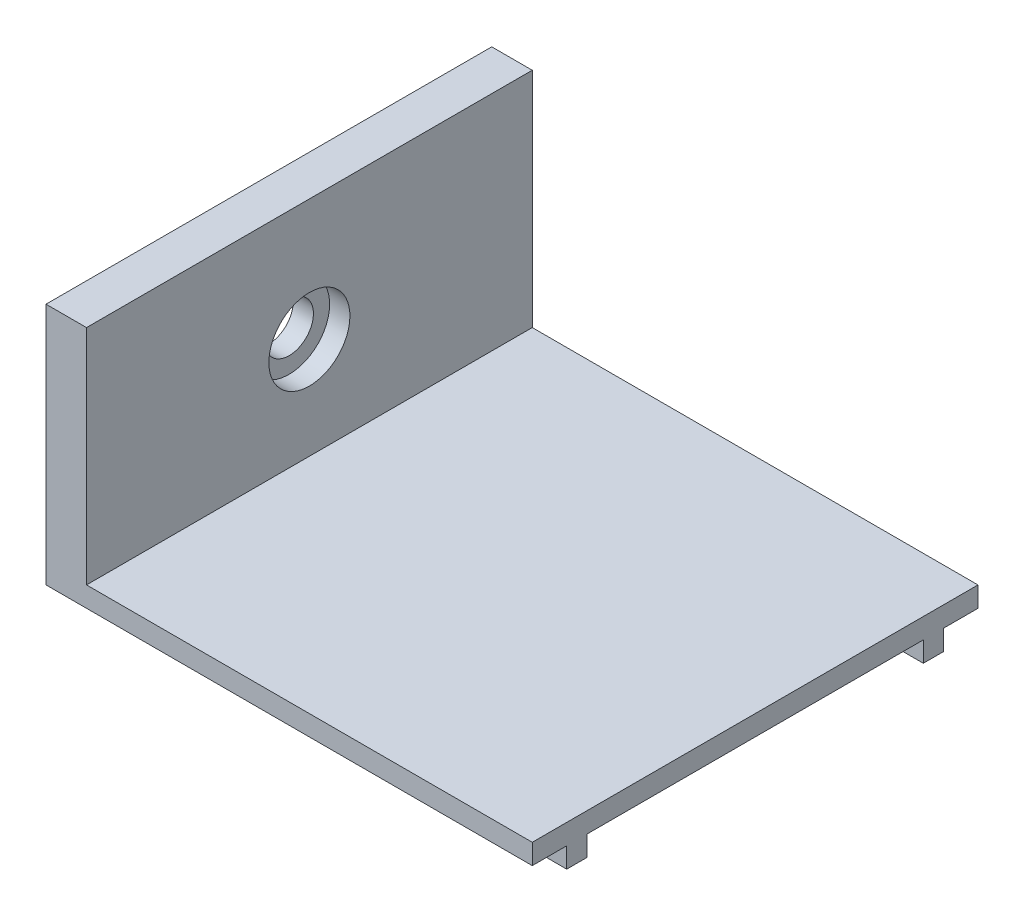
ISO-10303-21;
HEADER;
FILE_DESCRIPTION(('STEP AP214'),'2;1');
FILE_NAME('part.step','',(''),(''),'','','');
FILE_SCHEMA(('AUTOMOTIVE_DESIGN { 1 0 10303 214 1 1 1 1 }'));
ENDSEC;
DATA;
#1=APPLICATION_CONTEXT('core data for automotive mechanical design processes');
#2=APPLICATION_PROTOCOL_DEFINITION('international standard','automotive_design',2000,#1);
#3=PRODUCT_CONTEXT('',#1,'mechanical');
#4=PRODUCT('Part','Part','',(#3));
#5=PRODUCT_RELATED_PRODUCT_CATEGORY('part','',(#4));
#6=PRODUCT_DEFINITION_FORMATION('','',#4);
#7=PRODUCT_DEFINITION_CONTEXT('part definition',#1,'design');
#8=PRODUCT_DEFINITION('design','',#6,#7);
#9=PRODUCT_DEFINITION_SHAPE('','',#8);
#10=(LENGTH_UNIT() NAMED_UNIT(*) SI_UNIT(.MILLI.,.METRE.));
#11=(NAMED_UNIT(*) PLANE_ANGLE_UNIT() SI_UNIT($,.RADIAN.));
#12=(NAMED_UNIT(*) SI_UNIT($,.STERADIAN.) SOLID_ANGLE_UNIT());
#13=UNCERTAINTY_MEASURE_WITH_UNIT(LENGTH_MEASURE(1.E-05),#10,'distance_accuracy_value','');
#14=(GEOMETRIC_REPRESENTATION_CONTEXT(3) GLOBAL_UNCERTAINTY_ASSIGNED_CONTEXT((#13)) GLOBAL_UNIT_ASSIGNED_CONTEXT((#10,
#11,#12)) REPRESENTATION_CONTEXT('',''));
#15=CARTESIAN_POINT('',(0.,0.,0.));
#16=DIRECTION('',(0.,0.,1.));
#17=DIRECTION('',(1.,0.,0.));
#18=AXIS2_PLACEMENT_3D('',#15,#16,#17);
#19=CARTESIAN_POINT('',(120.,0.,110.));
#20=DIRECTION('',(0.,1.,0.));
#21=DIRECTION('',(-1.,0.,0.));
#22=AXIS2_PLACEMENT_3D('',#19,#20,#21);
#23=PLANE('',#22);
#24=DIRECTION('',(-1.,0.,0.));
#25=VECTOR('',#24,1.);
#26=CARTESIAN_POINT('',(0.,0.,13.5));
#27=LINE('',#26,#25);
#28=CARTESIAN_POINT('',(120.,0.,13.5));
#29=VERTEX_POINT('',#28);
#30=CARTESIAN_POINT('',(0.,0.,13.5));
#31=VERTEX_POINT('',#30);
#32=EDGE_CURVE('E58',#29,#31,#27,.T.);
#33=ORIENTED_EDGE('',*,*,#32,.F.);
#34=DIRECTION('',(0.,0.,-1.));
#35=VECTOR('',#34,1.);
#36=CARTESIAN_POINT('',(120.,0.,110.));
#37=LINE('',#36,#35);
#38=CARTESIAN_POINT('',(120.,0.,96.5));
#39=VERTEX_POINT('',#38);
#40=EDGE_CURVE('E43',#39,#29,#37,.T.);
#41=ORIENTED_EDGE('',*,*,#40,.F.);
#42=DIRECTION('',(1.,0.,0.));
#43=VECTOR('',#42,1.);
#44=CARTESIAN_POINT('',(0.,0.,96.5));
#45=LINE('',#44,#43);
#46=CARTESIAN_POINT('',(0.,0.,96.5));
#47=VERTEX_POINT('',#46);
#48=EDGE_CURVE('E145',#47,#39,#45,.T.);
#49=ORIENTED_EDGE('',*,*,#48,.F.);
#50=DIRECTION('',(0.,0.,-1.));
#51=VECTOR('',#50,1.);
#52=CARTESIAN_POINT('',(0.,0.,110.));
#53=LINE('',#52,#51);
#54=EDGE_CURVE('E231',#47,#31,#53,.T.);
#55=ORIENTED_EDGE('',*,*,#54,.T.);
#56=EDGE_LOOP('',(#33,#41,#49,#55));
#57=FACE_BOUND('',#56,.T.);
#58=ADVANCED_FACE('F35',(#57),#23,.F.);
#59=CARTESIAN_POINT('',(120.,0.,8.49999999999999));
#60=VERTEX_POINT('',#59);
#61=CARTESIAN_POINT('',(120.,0.,0.));
#62=VERTEX_POINT('',#61);
#63=EDGE_CURVE('E44',#60,#62,#37,.T.);
#64=ORIENTED_EDGE('',*,*,#63,.F.);
#65=DIRECTION('',(-1.,0.,0.));
#66=VECTOR('',#65,1.);
#67=CARTESIAN_POINT('',(0.,0.,8.49999999999999));
#68=LINE('',#67,#66);
#69=CARTESIAN_POINT('',(0.,0.,8.49999999999999));
#70=VERTEX_POINT('',#69);
#71=EDGE_CURVE('E143',#60,#70,#68,.T.);
#72=ORIENTED_EDGE('',*,*,#71,.T.);
#73=CARTESIAN_POINT('',(0.,0.,0.));
#74=VERTEX_POINT('',#73);
#75=EDGE_CURVE('E216',#70,#74,#53,.T.);
#76=ORIENTED_EDGE('',*,*,#75,.T.);
#77=DIRECTION('',(1.,0.,0.));
#78=VECTOR('',#77,1.);
#79=CARTESIAN_POINT('',(120.,0.,0.));
#80=LINE('',#79,#78);
#81=EDGE_CURVE('E201',#74,#62,#80,.T.);
#82=ORIENTED_EDGE('',*,*,#81,.T.);
#83=EDGE_LOOP('',(#64,#72,#76,#82));
#84=FACE_BOUND('',#83,.T.);
#85=ADVANCED_FACE('F256',(#84),#23,.F.);
#86=CARTESIAN_POINT('',(0.,0.,110.));
#87=VERTEX_POINT('',#86);
#88=CARTESIAN_POINT('',(0.,0.,101.5));
#89=VERTEX_POINT('',#88);
#90=EDGE_CURVE('E228',#87,#89,#53,.T.);
#91=ORIENTED_EDGE('',*,*,#90,.T.);
#92=DIRECTION('',(1.,0.,0.));
#93=VECTOR('',#92,1.);
#94=CARTESIAN_POINT('',(0.,0.,101.5));
#95=LINE('',#94,#93);
#96=CARTESIAN_POINT('',(120.,0.,101.5));
#97=VERTEX_POINT('',#96);
#98=EDGE_CURVE('E179',#89,#97,#95,.T.);
#99=ORIENTED_EDGE('',*,*,#98,.T.);
#100=CARTESIAN_POINT('',(120.,0.,110.));
#101=VERTEX_POINT('',#100);
#102=EDGE_CURVE('E11',#101,#97,#37,.T.);
#103=ORIENTED_EDGE('',*,*,#102,.F.);
#104=DIRECTION('',(1.,0.,0.));
#105=VECTOR('',#104,1.);
#106=CARTESIAN_POINT('',(120.,0.,110.));
#107=LINE('',#106,#105);
#108=EDGE_CURVE('E202',#87,#101,#107,.T.);
#109=ORIENTED_EDGE('',*,*,#108,.F.);
#110=EDGE_LOOP('',(#91,#99,#103,#109));
#111=FACE_BOUND('',#110,.T.);
#112=ADVANCED_FACE('F37',(#111),#23,.F.);
#113=CARTESIAN_POINT('',(120.,5.,110.));
#114=DIRECTION('',(-1.,0.,0.));
#115=DIRECTION('',(0.,0.,1.));
#116=AXIS2_PLACEMENT_3D('',#113,#114,#115);
#117=PLANE('',#116);
#118=DIRECTION('',(0.,1.,0.));
#119=VECTOR('',#118,1.);
#120=CARTESIAN_POINT('',(120.,5.,0.));
#121=LINE('',#120,#119);
#122=CARTESIAN_POINT('',(120.,5.,0.));
#123=VERTEX_POINT('',#122);
#124=EDGE_CURVE('E218',#62,#123,#121,.T.);
#125=ORIENTED_EDGE('',*,*,#124,.T.);
#126=DIRECTION('',(0.,0.,-1.));
#127=VECTOR('',#126,1.);
#128=CARTESIAN_POINT('',(120.,5.,110.));
#129=LINE('',#128,#127);
#130=CARTESIAN_POINT('',(120.,5.,110.));
#131=VERTEX_POINT('',#130);
#132=EDGE_CURVE('E239',#131,#123,#129,.T.);
#133=ORIENTED_EDGE('',*,*,#132,.F.);
#134=DIRECTION('',(0.,1.,0.));
#135=VECTOR('',#134,1.);
#136=CARTESIAN_POINT('',(120.,5.,110.));
#137=LINE('',#136,#135);
#138=EDGE_CURVE('E205',#101,#131,#137,.T.);
#139=ORIENTED_EDGE('',*,*,#138,.F.);
#140=ORIENTED_EDGE('',*,*,#102,.T.);
#141=DIRECTION('',(0.,1.,0.));
#142=VECTOR('',#141,1.);
#143=CARTESIAN_POINT('',(120.,-4.99999999999999,101.5));
#144=LINE('',#143,#142);
#145=CARTESIAN_POINT('',(120.,-4.99999999999999,101.5));
#146=VERTEX_POINT('',#145);
#147=EDGE_CURVE('E192',#146,#97,#144,.T.);
#148=ORIENTED_EDGE('',*,*,#147,.F.);
#149=DIRECTION('',(0.,0.,1.));
#150=VECTOR('',#149,1.);
#151=CARTESIAN_POINT('',(120.,-4.99999999999999,0.));
#152=LINE('',#151,#150);
#153=CARTESIAN_POINT('',(120.,-4.99999999999999,96.5));
#154=VERTEX_POINT('',#153);
#155=EDGE_CURVE('E181',#154,#146,#152,.T.);
#156=ORIENTED_EDGE('',*,*,#155,.F.);
#157=DIRECTION('',(0.,1.,0.));
#158=VECTOR('',#157,1.);
#159=CARTESIAN_POINT('',(120.,-4.99999999999999,96.5));
#160=LINE('',#159,#158);
#161=EDGE_CURVE('E195',#154,#39,#160,.T.);
#162=ORIENTED_EDGE('',*,*,#161,.T.);
#163=ORIENTED_EDGE('',*,*,#40,.T.);
#164=DIRECTION('',(0.,1.,0.));
#165=VECTOR('',#164,1.);
#166=CARTESIAN_POINT('',(120.,-4.99999999999999,13.5));
#167=LINE('',#166,#165);
#168=CARTESIAN_POINT('',(120.,-4.99999999999999,13.5));
#169=VERTEX_POINT('',#168);
#170=EDGE_CURVE('E146',#169,#29,#167,.T.);
#171=ORIENTED_EDGE('',*,*,#170,.F.);
#172=DIRECTION('',(0.,0.,1.));
#173=VECTOR('',#172,1.);
#174=CARTESIAN_POINT('',(120.,-4.99999999999999,0.));
#175=LINE('',#174,#173);
#176=CARTESIAN_POINT('',(120.,-4.99999999999999,8.49999999999999));
#177=VERTEX_POINT('',#176);
#178=EDGE_CURVE('E149',#177,#169,#175,.T.);
#179=ORIENTED_EDGE('',*,*,#178,.F.);
#180=DIRECTION('',(0.,1.,0.));
#181=VECTOR('',#180,1.);
#182=CARTESIAN_POINT('',(120.,-4.99999999999999,8.49999999999999));
#183=LINE('',#182,#181);
#184=EDGE_CURVE('E137',#177,#60,#183,.T.);
#185=ORIENTED_EDGE('',*,*,#184,.T.);
#186=ORIENTED_EDGE('',*,*,#63,.T.);
#187=EDGE_LOOP('',(#125,#133,#139,#140,#148,#156,#162,#163,#171,#179,#185,#186));
#188=FACE_BOUND('',#187,.T.);
#189=ADVANCED_FACE('F150',(#188),#117,.F.);
#190=CARTESIAN_POINT('',(10.,5.,110.));
#191=DIRECTION('',(0.,-1.,0.));
#192=DIRECTION('',(1.,0.,0.));
#193=AXIS2_PLACEMENT_3D('',#190,#191,#192);
#194=PLANE('',#193);
#195=DIRECTION('',(-1.,0.,0.));
#196=VECTOR('',#195,1.);
#197=CARTESIAN_POINT('',(10.,5.,0.));
#198=LINE('',#197,#196);
#199=CARTESIAN_POINT('',(10.,5.,0.));
#200=VERTEX_POINT('',#199);
#201=EDGE_CURVE('E220',#123,#200,#198,.T.);
#202=ORIENTED_EDGE('',*,*,#201,.T.);
#203=DIRECTION('',(0.,0.,-1.));
#204=VECTOR('',#203,1.);
#205=CARTESIAN_POINT('',(10.,5.,110.));
#206=LINE('',#205,#204);
#207=CARTESIAN_POINT('',(10.,5.,110.));
#208=VERTEX_POINT('',#207);
#209=EDGE_CURVE('E237',#208,#200,#206,.T.);
#210=ORIENTED_EDGE('',*,*,#209,.F.);
#211=DIRECTION('',(-1.,0.,0.));
#212=VECTOR('',#211,1.);
#213=CARTESIAN_POINT('',(10.,5.,110.));
#214=LINE('',#213,#212);
#215=EDGE_CURVE('E208',#131,#208,#214,.T.);
#216=ORIENTED_EDGE('',*,*,#215,.F.);
#217=ORIENTED_EDGE('',*,*,#132,.T.);
#218=EDGE_LOOP('',(#202,#210,#216,#217));
#219=FACE_BOUND('',#218,.T.);
#220=ADVANCED_FACE('F292',(#219),#194,.F.);
#221=CARTESIAN_POINT('',(10.,60.,110.));
#222=DIRECTION('',(-1.,0.,0.));
#223=DIRECTION('',(0.,-1.,0.));
#224=AXIS2_PLACEMENT_3D('',#221,#222,#223);
#225=PLANE('',#224);
#226=CARTESIAN_POINT('',(10.,30.,55.));
#227=DIRECTION('',(1.,0.,0.));
#228=DIRECTION('',(0.,1.,0.));
#229=AXIS2_PLACEMENT_3D('',#226,#227,#228);
#230=CIRCLE('',#229,10.);
#231=CARTESIAN_POINT('',(10.,40.,55.));
#232=VERTEX_POINT('',#231);
#233=EDGE_CURVE('E475',#232,#232,#230,.T.);
#234=ORIENTED_EDGE('',*,*,#233,.F.);
#235=EDGE_LOOP('',(#234));
#236=FACE_BOUND('',#235,.T.);
#237=DIRECTION('',(0.,1.,0.));
#238=VECTOR('',#237,1.);
#239=CARTESIAN_POINT('',(10.,60.,0.));
#240=LINE('',#239,#238);
#241=CARTESIAN_POINT('',(10.,60.,0.));
#242=VERTEX_POINT('',#241);
#243=EDGE_CURVE('E222',#200,#242,#240,.T.);
#244=ORIENTED_EDGE('',*,*,#243,.T.);
#245=DIRECTION('',(0.,0.,-1.));
#246=VECTOR('',#245,1.);
#247=CARTESIAN_POINT('',(10.,60.,110.));
#248=LINE('',#247,#246);
#249=CARTESIAN_POINT('',(10.,60.,110.));
#250=VERTEX_POINT('',#249);
#251=EDGE_CURVE('E234',#250,#242,#248,.T.);
#252=ORIENTED_EDGE('',*,*,#251,.F.);
#253=DIRECTION('',(0.,1.,0.));
#254=VECTOR('',#253,1.);
#255=CARTESIAN_POINT('',(10.,60.,110.));
#256=LINE('',#255,#254);
#257=EDGE_CURVE('E210',#208,#250,#256,.T.);
#258=ORIENTED_EDGE('',*,*,#257,.F.);
#259=ORIENTED_EDGE('',*,*,#209,.T.);
#260=EDGE_LOOP('',(#244,#252,#258,#259));
#261=FACE_BOUND('',#260,.T.);
#262=ADVANCED_FACE('F380',(#236,#261),#225,.F.);
#263=CARTESIAN_POINT('',(0.,60.,110.));
#264=DIRECTION('',(0.,-1.,0.));
#265=DIRECTION('',(0.,0.,-1.));
#266=AXIS2_PLACEMENT_3D('',#263,#264,#265);
#267=PLANE('',#266);
#268=DIRECTION('',(-1.,0.,0.));
#269=VECTOR('',#268,1.);
#270=CARTESIAN_POINT('',(0.,60.,0.));
#271=LINE('',#270,#269);
#272=CARTESIAN_POINT('',(0.,60.,0.));
#273=VERTEX_POINT('',#272);
#274=EDGE_CURVE('E224',#242,#273,#271,.T.);
#275=ORIENTED_EDGE('',*,*,#274,.T.);
#276=DIRECTION('',(0.,0.,-1.));
#277=VECTOR('',#276,1.);
#278=CARTESIAN_POINT('',(0.,60.,110.));
#279=LINE('',#278,#277);
#280=CARTESIAN_POINT('',(0.,60.,110.));
#281=VERTEX_POINT('',#280);
#282=EDGE_CURVE('E230',#281,#273,#279,.T.);
#283=ORIENTED_EDGE('',*,*,#282,.F.);
#284=DIRECTION('',(-1.,0.,0.));
#285=VECTOR('',#284,1.);
#286=CARTESIAN_POINT('',(0.,60.,110.));
#287=LINE('',#286,#285);
#288=EDGE_CURVE('E212',#250,#281,#287,.T.);
#289=ORIENTED_EDGE('',*,*,#288,.F.);
#290=ORIENTED_EDGE('',*,*,#251,.T.);
#291=EDGE_LOOP('',(#275,#283,#289,#290));
#292=FACE_BOUND('',#291,.T.);
#293=ADVANCED_FACE('F361',(#292),#267,.F.);
#294=CARTESIAN_POINT('',(0.,0.,110.));
#295=DIRECTION('',(1.,0.,0.));
#296=DIRECTION('',(0.,0.,-1.));
#297=AXIS2_PLACEMENT_3D('',#294,#295,#296);
#298=PLANE('',#297);
#299=CARTESIAN_POINT('',(0.,30.,55.));
#300=DIRECTION('',(-1.,0.,0.));
#301=DIRECTION('',(0.,0.,1.));
#302=AXIS2_PLACEMENT_3D('',#299,#300,#301);
#303=CIRCLE('',#302,5.99999999999999);
#304=CARTESIAN_POINT('',(0.,30.,61.));
#305=VERTEX_POINT('',#304);
#306=EDGE_CURVE('E163',#305,#305,#303,.T.);
#307=ORIENTED_EDGE('',*,*,#306,.F.);
#308=EDGE_LOOP('',(#307));
#309=FACE_BOUND('',#308,.T.);
#310=DIRECTION('',(0.,-1.,0.));
#311=VECTOR('',#310,1.);
#312=CARTESIAN_POINT('',(0.,0.,0.));
#313=LINE('',#312,#311);
#314=EDGE_CURVE('E206',#273,#74,#313,.T.);
#315=ORIENTED_EDGE('',*,*,#314,.T.);
#316=ORIENTED_EDGE('',*,*,#75,.F.);
#317=DIRECTION('',(0.,1.,0.));
#318=VECTOR('',#317,1.);
#319=CARTESIAN_POINT('',(0.,-5.,8.49999999999999));
#320=LINE('',#319,#318);
#321=CARTESIAN_POINT('',(0.,-5.,8.49999999999999));
#322=VERTEX_POINT('',#321);
#323=EDGE_CURVE('E168',#322,#70,#320,.T.);
#324=ORIENTED_EDGE('',*,*,#323,.F.);
#325=DIRECTION('',(0.,0.,-1.));
#326=VECTOR('',#325,1.);
#327=CARTESIAN_POINT('',(0.,-5.,0.));
#328=LINE('',#327,#326);
#329=CARTESIAN_POINT('',(0.,-5.,13.5));
#330=VERTEX_POINT('',#329);
#331=EDGE_CURVE('E158',#330,#322,#328,.T.);
#332=ORIENTED_EDGE('',*,*,#331,.F.);
#333=DIRECTION('',(0.,1.,0.));
#334=VECTOR('',#333,1.);
#335=CARTESIAN_POINT('',(0.,-5.,13.5));
#336=LINE('',#335,#334);
#337=EDGE_CURVE('E171',#330,#31,#336,.T.);
#338=ORIENTED_EDGE('',*,*,#337,.T.);
#339=ORIENTED_EDGE('',*,*,#54,.F.);
#340=DIRECTION('',(0.,1.,0.));
#341=VECTOR('',#340,1.);
#342=CARTESIAN_POINT('',(0.,-5.,96.5));
#343=LINE('',#342,#341);
#344=CARTESIAN_POINT('',(0.,-5.,96.5));
#345=VERTEX_POINT('',#344);
#346=EDGE_CURVE('E198',#345,#47,#343,.T.);
#347=ORIENTED_EDGE('',*,*,#346,.F.);
#348=DIRECTION('',(0.,0.,-1.));
#349=VECTOR('',#348,1.);
#350=CARTESIAN_POINT('',(0.,-5.,0.));
#351=LINE('',#350,#349);
#352=CARTESIAN_POINT('',(0.,-5.,101.5));
#353=VERTEX_POINT('',#352);
#354=EDGE_CURVE('E175',#353,#345,#351,.T.);
#355=ORIENTED_EDGE('',*,*,#354,.F.);
#356=DIRECTION('',(0.,1.,0.));
#357=VECTOR('',#356,1.);
#358=CARTESIAN_POINT('',(0.,-5.,101.5));
#359=LINE('',#358,#357);
#360=EDGE_CURVE('E186',#353,#89,#359,.T.);
#361=ORIENTED_EDGE('',*,*,#360,.T.);
#362=ORIENTED_EDGE('',*,*,#90,.F.);
#363=DIRECTION('',(0.,-1.,0.));
#364=VECTOR('',#363,1.);
#365=CARTESIAN_POINT('',(0.,0.,110.));
#366=LINE('',#365,#364);
#367=EDGE_CURVE('E214',#281,#87,#366,.T.);
#368=ORIENTED_EDGE('',*,*,#367,.F.);
#369=ORIENTED_EDGE('',*,*,#282,.T.);
#370=EDGE_LOOP('',(#315,#316,#324,#332,#338,#339,#347,#355,#361,#362,#368,#369));
#371=FACE_BOUND('',#370,.T.);
#372=ADVANCED_FACE('F253',(#309,#371),#298,.F.);
#373=CARTESIAN_POINT('',(0.,0.,110.));
#374=DIRECTION('',(0.,0.,-1.));
#375=DIRECTION('',(-1.,0.,0.));
#376=AXIS2_PLACEMENT_3D('',#373,#374,#375);
#377=PLANE('',#376);
#378=ORIENTED_EDGE('',*,*,#108,.T.);
#379=ORIENTED_EDGE('',*,*,#138,.T.);
#380=ORIENTED_EDGE('',*,*,#215,.T.);
#381=ORIENTED_EDGE('',*,*,#257,.T.);
#382=ORIENTED_EDGE('',*,*,#288,.T.);
#383=ORIENTED_EDGE('',*,*,#367,.T.);
#384=EDGE_LOOP('',(#378,#379,#380,#381,#382,#383));
#385=FACE_BOUND('',#384,.T.);
#386=ADVANCED_FACE('F360',(#385),#377,.F.);
#387=CARTESIAN_POINT('',(0.,0.,0.));
#388=DIRECTION('',(0.,0.,-1.));
#389=DIRECTION('',(-1.,0.,0.));
#390=AXIS2_PLACEMENT_3D('',#387,#388,#389);
#391=PLANE('',#390);
#392=ORIENTED_EDGE('',*,*,#81,.F.);
#393=ORIENTED_EDGE('',*,*,#314,.F.);
#394=ORIENTED_EDGE('',*,*,#274,.F.);
#395=ORIENTED_EDGE('',*,*,#243,.F.);
#396=ORIENTED_EDGE('',*,*,#201,.F.);
#397=ORIENTED_EDGE('',*,*,#124,.F.);
#398=EDGE_LOOP('',(#392,#393,#394,#395,#396,#397));
#399=FACE_BOUND('',#398,.T.);
#400=ADVANCED_FACE('F272',(#399),#391,.T.);
#401=CARTESIAN_POINT('',(0.,-5.,96.5));
#402=DIRECTION('',(0.,0.,1.));
#403=DIRECTION('',(1.,0.,0.));
#404=AXIS2_PLACEMENT_3D('',#401,#402,#403);
#405=PLANE('',#404);
#406=ORIENTED_EDGE('',*,*,#48,.T.);
#407=ORIENTED_EDGE('',*,*,#161,.F.);
#408=DIRECTION('',(1.,0.,0.));
#409=VECTOR('',#408,1.);
#410=CARTESIAN_POINT('',(0.,-5.,96.5));
#411=LINE('',#410,#409);
#412=EDGE_CURVE('E178',#345,#154,#411,.T.);
#413=ORIENTED_EDGE('',*,*,#412,.F.);
#414=ORIENTED_EDGE('',*,*,#346,.T.);
#415=EDGE_LOOP('',(#406,#407,#413,#414));
#416=FACE_BOUND('',#415,.T.);
#417=ADVANCED_FACE('F299',(#416),#405,.F.);
#418=CARTESIAN_POINT('',(0.,-5.,101.5));
#419=DIRECTION('',(0.,0.,1.));
#420=DIRECTION('',(1.,0.,0.));
#421=AXIS2_PLACEMENT_3D('',#418,#419,#420);
#422=PLANE('',#421);
#423=ORIENTED_EDGE('',*,*,#98,.F.);
#424=ORIENTED_EDGE('',*,*,#360,.F.);
#425=DIRECTION('',(1.,0.,0.));
#426=VECTOR('',#425,1.);
#427=CARTESIAN_POINT('',(0.,-5.,101.5));
#428=LINE('',#427,#426);
#429=EDGE_CURVE('E183',#353,#146,#428,.T.);
#430=ORIENTED_EDGE('',*,*,#429,.T.);
#431=ORIENTED_EDGE('',*,*,#147,.T.);
#432=EDGE_LOOP('',(#423,#424,#430,#431));
#433=FACE_BOUND('',#432,.T.);
#434=ADVANCED_FACE('F304',(#433),#422,.T.);
#435=CARTESIAN_POINT('',(0.,-5.,0.));
#436=DIRECTION('',(0.,-1.,0.));
#437=DIRECTION('',(1.,0.,0.));
#438=AXIS2_PLACEMENT_3D('',#435,#436,#437);
#439=PLANE('',#438);
#440=ORIENTED_EDGE('',*,*,#354,.T.);
#441=ORIENTED_EDGE('',*,*,#412,.T.);
#442=ORIENTED_EDGE('',*,*,#155,.T.);
#443=ORIENTED_EDGE('',*,*,#429,.F.);
#444=EDGE_LOOP('',(#440,#441,#442,#443));
#445=FACE_BOUND('',#444,.T.);
#446=ADVANCED_FACE('F315',(#445),#439,.T.);
#447=CARTESIAN_POINT('',(0.,-5.,8.49999999999999));
#448=DIRECTION('',(0.,0.,-1.));
#449=DIRECTION('',(-1.,0.,0.));
#450=AXIS2_PLACEMENT_3D('',#447,#448,#449);
#451=PLANE('',#450);
#452=ORIENTED_EDGE('',*,*,#71,.F.);
#453=ORIENTED_EDGE('',*,*,#184,.F.);
#454=DIRECTION('',(-1.,0.,0.));
#455=VECTOR('',#454,1.);
#456=CARTESIAN_POINT('',(0.,-5.,8.49999999999999));
#457=LINE('',#456,#455);
#458=EDGE_CURVE('E142',#177,#322,#457,.T.);
#459=ORIENTED_EDGE('',*,*,#458,.T.);
#460=ORIENTED_EDGE('',*,*,#323,.T.);
#461=EDGE_LOOP('',(#452,#453,#459,#460));
#462=FACE_BOUND('',#461,.T.);
#463=ADVANCED_FACE('F139',(#462),#451,.T.);
#464=CARTESIAN_POINT('',(0.,-5.,13.5));
#465=DIRECTION('',(0.,0.,-1.));
#466=DIRECTION('',(-1.,0.,0.));
#467=AXIS2_PLACEMENT_3D('',#464,#465,#466);
#468=PLANE('',#467);
#469=ORIENTED_EDGE('',*,*,#32,.T.);
#470=ORIENTED_EDGE('',*,*,#337,.F.);
#471=DIRECTION('',(-1.,0.,0.));
#472=VECTOR('',#471,1.);
#473=CARTESIAN_POINT('',(0.,-5.,13.5));
#474=LINE('',#473,#472);
#475=EDGE_CURVE('E154',#169,#330,#474,.T.);
#476=ORIENTED_EDGE('',*,*,#475,.F.);
#477=ORIENTED_EDGE('',*,*,#170,.T.);
#478=EDGE_LOOP('',(#469,#470,#476,#477));
#479=FACE_BOUND('',#478,.T.);
#480=ADVANCED_FACE('F249',(#479),#468,.F.);
#481=CARTESIAN_POINT('',(0.,-5.,0.));
#482=DIRECTION('',(0.,-1.,0.));
#483=DIRECTION('',(1.,0.,0.));
#484=AXIS2_PLACEMENT_3D('',#481,#482,#483);
#485=PLANE('',#484);
#486=ORIENTED_EDGE('',*,*,#458,.F.);
#487=ORIENTED_EDGE('',*,*,#178,.T.);
#488=ORIENTED_EDGE('',*,*,#475,.T.);
#489=ORIENTED_EDGE('',*,*,#331,.T.);
#490=EDGE_LOOP('',(#486,#487,#488,#489));
#491=FACE_BOUND('',#490,.T.);
#492=ADVANCED_FACE('F156',(#491),#485,.T.);
#493=CARTESIAN_POINT('',(5.,30.,55.));
#494=DIRECTION('',(-1.,0.,0.));
#495=DIRECTION('',(0.,0.,1.));
#496=AXIS2_PLACEMENT_3D('',#493,#494,#495);
#497=CYLINDRICAL_SURFACE('',#496,5.99999999999999);
#498=CARTESIAN_POINT('',(5.,30.,55.));
#499=DIRECTION('',(-1.,0.,0.));
#500=DIRECTION('',(0.,0.,1.));
#501=AXIS2_PLACEMENT_3D('',#498,#499,#500);
#502=CIRCLE('',#501,5.99999999999999);
#503=CARTESIAN_POINT('',(5.,30.,61.));
#504=VERTEX_POINT('',#503);
#505=EDGE_CURVE('E477',#504,#504,#502,.T.);
#506=ORIENTED_EDGE('',*,*,#505,.F.);
#507=EDGE_LOOP('',(#506));
#508=FACE_BOUND('',#507,.T.);
#509=ORIENTED_EDGE('',*,*,#306,.T.);
#510=EDGE_LOOP('',(#509));
#511=FACE_BOUND('',#510,.T.);
#512=ADVANCED_FACE('F350',(#508,#511),#497,.F.);
#513=CARTESIAN_POINT('',(5.,30.,55.));
#514=DIRECTION('',(1.,0.,0.));
#515=DIRECTION('',(0.,1.,0.));
#516=AXIS2_PLACEMENT_3D('',#513,#514,#515);
#517=PLANE('',#516);
#518=CARTESIAN_POINT('',(5.,30.,55.));
#519=DIRECTION('',(1.,0.,0.));
#520=DIRECTION('',(0.,1.,0.));
#521=AXIS2_PLACEMENT_3D('',#518,#519,#520);
#522=CIRCLE('',#521,10.);
#523=CARTESIAN_POINT('',(5.,40.,55.));
#524=VERTEX_POINT('',#523);
#525=EDGE_CURVE('E472',#524,#524,#522,.T.);
#526=ORIENTED_EDGE('',*,*,#525,.T.);
#527=EDGE_LOOP('',(#526));
#528=FACE_BOUND('',#527,.T.);
#529=ORIENTED_EDGE('',*,*,#505,.T.);
#530=EDGE_LOOP('',(#529));
#531=FACE_BOUND('',#530,.T.);
#532=ADVANCED_FACE('F372',(#528,#531),#517,.T.);
#533=CARTESIAN_POINT('',(5.,30.,55.));
#534=DIRECTION('',(1.,0.,0.));
#535=DIRECTION('',(0.,1.,0.));
#536=AXIS2_PLACEMENT_3D('',#533,#534,#535);
#537=CYLINDRICAL_SURFACE('',#536,10.);
#538=ORIENTED_EDGE('',*,*,#525,.F.);
#539=EDGE_LOOP('',(#538));
#540=FACE_BOUND('',#539,.T.);
#541=ORIENTED_EDGE('',*,*,#233,.T.);
#542=EDGE_LOOP('',(#541));
#543=FACE_BOUND('',#542,.T.);
#544=ADVANCED_FACE('F394',(#540,#543),#537,.F.);
#545=CLOSED_SHELL('',(#58,#85,#112,#189,#220,#262,#293,#372,#386,#400,#417,#434,#446,#463,#480,
#492,#512,#532,#544));
#546=MANIFOLD_SOLID_BREP('B2',#545);
#547=ADVANCED_BREP_SHAPE_REPRESENTATION('',(#18,#546),#14);
#548=SHAPE_DEFINITION_REPRESENTATION(#9,#547);
ENDSEC;
END-ISO-10303-21;
